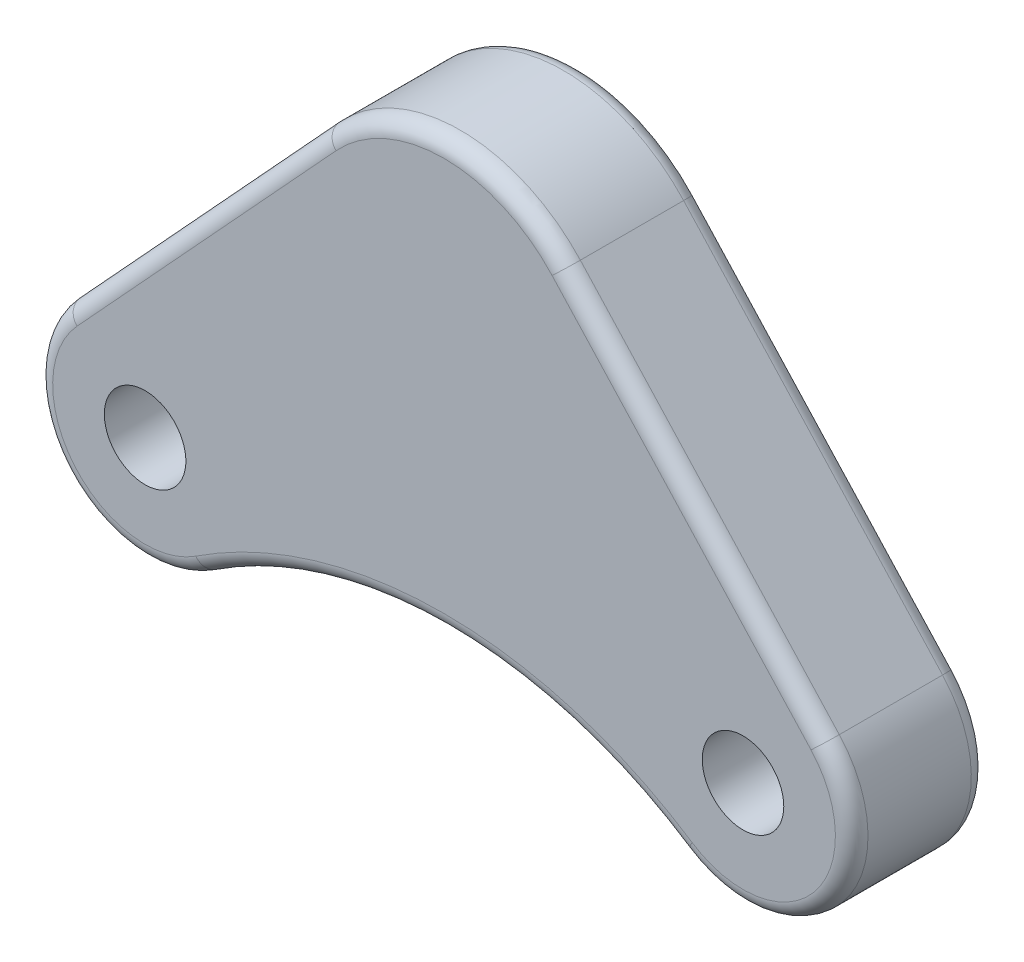
ISO-10303-21;
HEADER;
FILE_DESCRIPTION(('STEP AP214'),'2;1');
FILE_NAME('part.step','',(''),(''),'','','');
FILE_SCHEMA(('AUTOMOTIVE_DESIGN { 1 0 10303 214 1 1 1 1 }'));
ENDSEC;
DATA;
#1=APPLICATION_CONTEXT('core data for automotive mechanical design processes');
#2=APPLICATION_PROTOCOL_DEFINITION('international standard','automotive_design',2000,#1);
#3=PRODUCT_CONTEXT('',#1,'mechanical');
#4=PRODUCT('Part','Part','',(#3));
#5=PRODUCT_RELATED_PRODUCT_CATEGORY('part','',(#4));
#6=PRODUCT_DEFINITION_FORMATION('','',#4);
#7=PRODUCT_DEFINITION_CONTEXT('part definition',#1,'design');
#8=PRODUCT_DEFINITION('design','',#6,#7);
#9=PRODUCT_DEFINITION_SHAPE('','',#8);
#10=(LENGTH_UNIT() NAMED_UNIT(*) SI_UNIT(.MILLI.,.METRE.));
#11=(NAMED_UNIT(*) PLANE_ANGLE_UNIT() SI_UNIT($,.RADIAN.));
#12=(NAMED_UNIT(*) SI_UNIT($,.STERADIAN.) SOLID_ANGLE_UNIT());
#13=UNCERTAINTY_MEASURE_WITH_UNIT(LENGTH_MEASURE(1.E-05),#10,'distance_accuracy_value','');
#14=(GEOMETRIC_REPRESENTATION_CONTEXT(3) GLOBAL_UNCERTAINTY_ASSIGNED_CONTEXT((#13)) GLOBAL_UNIT_ASSIGNED_CONTEXT((#10,
#11,#12)) REPRESENTATION_CONTEXT('',''));
#15=CARTESIAN_POINT('',(0.,0.,0.));
#16=DIRECTION('',(0.,0.,1.));
#17=DIRECTION('',(1.,0.,0.));
#18=AXIS2_PLACEMENT_3D('',#15,#16,#17);
#19=CARTESIAN_POINT('',(0.,0.,25.));
#20=DIRECTION('',(0.,0.,-1.));
#21=DIRECTION('',(-1.,0.,0.));
#22=AXIS2_PLACEMENT_3D('',#19,#20,#21);
#23=PLANE('',#22);
#24=DIRECTION('',(-0.677147129080065,0.735847651065508,0.));
#25=VECTOR('',#24,1.);
#26=CARTESIAN_POINT('',(19.8678865787687,18.2829724851618,25.));
#27=LINE('',#26,#25);
#28=CARTESIAN_POINT('',(67.5094100681136,-33.4884988056389,25.));
#29=VERTEX_POINT('',#28);
#30=CARTESIAN_POINT('',(19.8678865787687,18.2829724851618,25.));
#31=VERTEX_POINT('',#30);
#32=EDGE_CURVE('E57',#29,#31,#27,.T.);
#33=ORIENTED_EDGE('',*,*,#32,.T.);
#34=CARTESIAN_POINT('',(0.,0.,25.));
#35=DIRECTION('',(0.,0.,-1.));
#36=DIRECTION('',(-1.,0.,0.));
#37=AXIS2_PLACEMENT_3D('',#34,#35,#36);
#38=CIRCLE('',#37,27.);
#39=CARTESIAN_POINT('',(-19.8678865787687,18.2829724851618,25.));
#40=VERTEX_POINT('',#39);
#41=EDGE_CURVE('E187',#31,#40,#38,.F.);
#42=ORIENTED_EDGE('',*,*,#41,.T.);
#43=DIRECTION('',(-0.677147129080065,-0.735847651065508,0.));
#44=VECTOR('',#43,1.);
#45=CARTESIAN_POINT('',(-19.8678865787687,18.2829724851618,25.));
#46=LINE('',#45,#44);
#47=CARTESIAN_POINT('',(-67.5094100681136,-33.4884988056389,25.));
#48=VERTEX_POINT('',#47);
#49=EDGE_CURVE('E195',#40,#48,#46,.T.);
#50=ORIENTED_EDGE('',*,*,#49,.T.);
#51=CARTESIAN_POINT('',(-55.,-45.,25.));
#52=DIRECTION('',(0.,0.,-1.));
#53=DIRECTION('',(-1.,0.,0.));
#54=AXIS2_PLACEMENT_3D('',#51,#52,#53);
#55=CIRCLE('',#54,17.);
#56=CARTESIAN_POINT('',(-45.65,-59.1977991252166,25.));
#57=VERTEX_POINT('',#56);
#58=EDGE_CURVE('E193',#48,#57,#55,.F.);
#59=ORIENTED_EDGE('',*,*,#58,.T.);
#60=CARTESIAN_POINT('',(0.,-128.51646544245,25.));
#61=DIRECTION('',(0.,0.,-1.));
#62=DIRECTION('',(-1.,0.,0.));
#63=AXIS2_PLACEMENT_3D('',#60,#61,#62);
#64=CIRCLE('',#63,83.);
#65=CARTESIAN_POINT('',(45.65,-59.1977991252166,25.));
#66=VERTEX_POINT('',#65);
#67=EDGE_CURVE('E191',#57,#66,#64,.T.);
#68=ORIENTED_EDGE('',*,*,#67,.T.);
#69=CARTESIAN_POINT('',(55.,-45.,25.));
#70=DIRECTION('',(0.,0.,-1.));
#71=DIRECTION('',(-1.,0.,0.));
#72=AXIS2_PLACEMENT_3D('',#69,#70,#71);
#73=CIRCLE('',#72,17.);
#74=EDGE_CURVE('E62',#66,#29,#73,.F.);
#75=ORIENTED_EDGE('',*,*,#74,.T.);
#76=EDGE_LOOP('',(#33,#42,#50,#59,#68,#75));
#77=FACE_BOUND('',#76,.T.);
#78=CARTESIAN_POINT('',(55.,-45.,25.));
#79=DIRECTION('',(0.,0.,1.));
#80=DIRECTION('',(1.,0.,0.));
#81=AXIS2_PLACEMENT_3D('',#78,#79,#80);
#82=CIRCLE('',#81,7.5);
#83=CARTESIAN_POINT('',(62.5,-45.,25.));
#84=VERTEX_POINT('',#83);
#85=EDGE_CURVE('E237',#84,#84,#82,.T.);
#86=ORIENTED_EDGE('',*,*,#85,.F.);
#87=EDGE_LOOP('',(#86));
#88=FACE_BOUND('',#87,.T.);
#89=CARTESIAN_POINT('',(-55.,-45.,25.));
#90=DIRECTION('',(0.,0.,1.));
#91=DIRECTION('',(-1.,0.,0.));
#92=AXIS2_PLACEMENT_3D('',#89,#90,#91);
#93=CIRCLE('',#92,7.5);
#94=CARTESIAN_POINT('',(-62.5,-45.,25.));
#95=VERTEX_POINT('',#94);
#96=EDGE_CURVE('E241',#95,#95,#93,.T.);
#97=ORIENTED_EDGE('',*,*,#96,.F.);
#98=EDGE_LOOP('',(#97));
#99=FACE_BOUND('',#98,.T.);
#100=ADVANCED_FACE('F40',(#77,#88,#99),#23,.F.);
#101=CARTESIAN_POINT('',(0.,0.,0.));
#102=DIRECTION('',(0.,0.,-1.));
#103=DIRECTION('',(-1.,0.,0.));
#104=AXIS2_PLACEMENT_3D('',#101,#102,#103);
#105=PLANE('',#104);
#106=DIRECTION('',(-0.677147129080065,0.735847651065508,0.));
#107=VECTOR('',#106,1.);
#108=CARTESIAN_POINT('',(67.5094100681137,-33.4884988056389,0.));
#109=LINE('',#108,#107);
#110=CARTESIAN_POINT('',(19.8678865787687,18.2829724851618,0.));
#111=VERTEX_POINT('',#110);
#112=CARTESIAN_POINT('',(67.5094100681136,-33.4884988056389,0.));
#113=VERTEX_POINT('',#112);
#114=EDGE_CURVE('E224',#111,#113,#109,.F.);
#115=ORIENTED_EDGE('',*,*,#114,.T.);
#116=CARTESIAN_POINT('',(55.,-45.,0.));
#117=DIRECTION('',(0.,0.,-1.));
#118=DIRECTION('',(-1.,0.,0.));
#119=AXIS2_PLACEMENT_3D('',#116,#117,#118);
#120=CIRCLE('',#119,17.);
#121=CARTESIAN_POINT('',(45.65,-59.1977991252166,0.));
#122=VERTEX_POINT('',#121);
#123=EDGE_CURVE('E213',#113,#122,#120,.T.);
#124=ORIENTED_EDGE('',*,*,#123,.T.);
#125=CARTESIAN_POINT('',(0.,-128.51646544245,0.));
#126=DIRECTION('',(0.,0.,-1.));
#127=DIRECTION('',(-1.,0.,0.));
#128=AXIS2_PLACEMENT_3D('',#125,#126,#127);
#129=CIRCLE('',#128,83.);
#130=CARTESIAN_POINT('',(-45.65,-59.1977991252166,0.));
#131=VERTEX_POINT('',#130);
#132=EDGE_CURVE('E216',#122,#131,#129,.F.);
#133=ORIENTED_EDGE('',*,*,#132,.T.);
#134=CARTESIAN_POINT('',(-55.,-45.,0.));
#135=DIRECTION('',(0.,0.,-1.));
#136=DIRECTION('',(-1.,0.,0.));
#137=AXIS2_PLACEMENT_3D('',#134,#135,#136);
#138=CIRCLE('',#137,17.);
#139=CARTESIAN_POINT('',(-67.5094100681136,-33.4884988056389,0.));
#140=VERTEX_POINT('',#139);
#141=EDGE_CURVE('E218',#131,#140,#138,.T.);
#142=ORIENTED_EDGE('',*,*,#141,.T.);
#143=DIRECTION('',(-0.677147129080065,-0.735847651065508,0.));
#144=VECTOR('',#143,1.);
#145=CARTESIAN_POINT('',(-19.8678865787687,18.2829724851618,0.));
#146=LINE('',#145,#144);
#147=CARTESIAN_POINT('',(-19.8678865787687,18.2829724851618,0.));
#148=VERTEX_POINT('',#147);
#149=EDGE_CURVE('E220',#140,#148,#146,.F.);
#150=ORIENTED_EDGE('',*,*,#149,.T.);
#151=CARTESIAN_POINT('',(0.,0.,0.));
#152=DIRECTION('',(0.,0.,-1.));
#153=DIRECTION('',(-1.,0.,0.));
#154=AXIS2_PLACEMENT_3D('',#151,#152,#153);
#155=CIRCLE('',#154,27.);
#156=EDGE_CURVE('E222',#148,#111,#155,.T.);
#157=ORIENTED_EDGE('',*,*,#156,.T.);
#158=EDGE_LOOP('',(#115,#124,#133,#142,#150,#157));
#159=FACE_BOUND('',#158,.T.);
#160=CARTESIAN_POINT('',(55.,-45.,0.));
#161=DIRECTION('',(0.,0.,1.));
#162=DIRECTION('',(1.,0.,0.));
#163=AXIS2_PLACEMENT_3D('',#160,#161,#162);
#164=CIRCLE('',#163,7.5);
#165=CARTESIAN_POINT('',(62.5,-45.,0.));
#166=VERTEX_POINT('',#165);
#167=EDGE_CURVE('E238',#166,#166,#164,.T.);
#168=ORIENTED_EDGE('',*,*,#167,.T.);
#169=EDGE_LOOP('',(#168));
#170=FACE_BOUND('',#169,.T.);
#171=CARTESIAN_POINT('',(-55.,-45.,0.));
#172=DIRECTION('',(0.,0.,1.));
#173=DIRECTION('',(-1.,0.,0.));
#174=AXIS2_PLACEMENT_3D('',#171,#172,#173);
#175=CIRCLE('',#174,7.5);
#176=CARTESIAN_POINT('',(-62.5,-45.,0.));
#177=VERTEX_POINT('',#176);
#178=EDGE_CURVE('E172',#177,#177,#175,.T.);
#179=ORIENTED_EDGE('',*,*,#178,.T.);
#180=EDGE_LOOP('',(#179));
#181=FACE_BOUND('',#180,.T.);
#182=ADVANCED_FACE('F253',(#159,#170,#181),#105,.T.);
#183=CARTESIAN_POINT('',(0.,0.,25.));
#184=DIRECTION('',(0.,0.,-1.));
#185=DIRECTION('',(-1.,0.,0.));
#186=AXIS2_PLACEMENT_3D('',#183,#184,#185);
#187=CYLINDRICAL_SURFACE('',#186,30.);
#188=DIRECTION('',(0.,0.,-1.));
#189=VECTOR('',#188,1.);
#190=CARTESIAN_POINT('',(22.0754295319652,20.314413872402,25.));
#191=LINE('',#190,#189);
#192=CARTESIAN_POINT('',(22.0754295319652,20.314413872402,22.));
#193=VERTEX_POINT('',#192);
#194=CARTESIAN_POINT('',(22.0754295319652,20.314413872402,3.));
#195=VERTEX_POINT('',#194);
#196=EDGE_CURVE('E135',#193,#195,#191,.T.);
#197=ORIENTED_EDGE('',*,*,#196,.T.);
#198=CARTESIAN_POINT('',(0.,0.,3.));
#199=DIRECTION('',(0.,0.,-1.));
#200=DIRECTION('',(-1.,0.,0.));
#201=AXIS2_PLACEMENT_3D('',#198,#199,#200);
#202=CIRCLE('',#201,30.);
#203=CARTESIAN_POINT('',(-22.0754295319652,20.314413872402,3.));
#204=VERTEX_POINT('',#203);
#205=EDGE_CURVE('E197',#195,#204,#202,.F.);
#206=ORIENTED_EDGE('',*,*,#205,.T.);
#207=DIRECTION('',(0.,0.,-1.));
#208=VECTOR('',#207,1.);
#209=CARTESIAN_POINT('',(-22.0754295319652,20.314413872402,25.));
#210=LINE('',#209,#208);
#211=CARTESIAN_POINT('',(-22.0754295319652,20.314413872402,22.));
#212=VERTEX_POINT('',#211);
#213=EDGE_CURVE('E155',#212,#204,#210,.T.);
#214=ORIENTED_EDGE('',*,*,#213,.F.);
#215=CARTESIAN_POINT('',(0.,0.,22.));
#216=DIRECTION('',(0.,0.,-1.));
#217=DIRECTION('',(-1.,0.,0.));
#218=AXIS2_PLACEMENT_3D('',#215,#216,#217);
#219=CIRCLE('',#218,30.);
#220=EDGE_CURVE('E199',#212,#193,#219,.T.);
#221=ORIENTED_EDGE('',*,*,#220,.T.);
#222=EDGE_LOOP('',(#197,#206,#214,#221));
#223=FACE_BOUND('',#222,.T.);
#224=ADVANCED_FACE('F258',(#223),#187,.T.);
#225=CARTESIAN_POINT('',(-22.0754295319652,20.314413872402,25.));
#226=DIRECTION('',(0.735847651065508,-0.677147129080065,0.));
#227=DIRECTION('',(0.677147129080065,0.735847651065508,0.));
#228=AXIS2_PLACEMENT_3D('',#225,#226,#227);
#229=PLANE('',#228);
#230=ORIENTED_EDGE('',*,*,#213,.T.);
#231=DIRECTION('',(-0.677147129080065,-0.735847651065508,0.));
#232=VECTOR('',#231,1.);
#233=CARTESIAN_POINT('',(-69.7169530213102,-31.4570574183987,3.));
#234=LINE('',#233,#232);
#235=CARTESIAN_POINT('',(-69.7169530213102,-31.4570574183987,3.));
#236=VERTEX_POINT('',#235);
#237=EDGE_CURVE('E201',#204,#236,#234,.T.);
#238=ORIENTED_EDGE('',*,*,#237,.T.);
#239=DIRECTION('',(0.,0.,-1.));
#240=VECTOR('',#239,1.);
#241=CARTESIAN_POINT('',(-69.7169530213102,-31.4570574183987,25.));
#242=LINE('',#241,#240);
#243=CARTESIAN_POINT('',(-69.7169530213102,-31.4570574183987,22.));
#244=VERTEX_POINT('',#243);
#245=EDGE_CURVE('E229',#244,#236,#242,.T.);
#246=ORIENTED_EDGE('',*,*,#245,.F.);
#247=DIRECTION('',(-0.677147129080065,-0.735847651065508,0.));
#248=VECTOR('',#247,1.);
#249=CARTESIAN_POINT('',(-22.0754295319652,20.314413872402,22.));
#250=LINE('',#249,#248);
#251=EDGE_CURVE('E203',#244,#212,#250,.F.);
#252=ORIENTED_EDGE('',*,*,#251,.T.);
#253=EDGE_LOOP('',(#230,#238,#246,#252));
#254=FACE_BOUND('',#253,.T.);
#255=ADVANCED_FACE('F277',(#254),#229,.F.);
#256=CARTESIAN_POINT('',(-55.,-45.,25.));
#257=DIRECTION('',(0.,0.,-1.));
#258=DIRECTION('',(-1.,0.,0.));
#259=AXIS2_PLACEMENT_3D('',#256,#257,#258);
#260=CYLINDRICAL_SURFACE('',#259,20.);
#261=ORIENTED_EDGE('',*,*,#245,.T.);
#262=CARTESIAN_POINT('',(-55.,-45.,3.));
#263=DIRECTION('',(0.,0.,-1.));
#264=DIRECTION('',(-1.,0.,0.));
#265=AXIS2_PLACEMENT_3D('',#262,#263,#264);
#266=CIRCLE('',#265,20.);
#267=CARTESIAN_POINT('',(-44.,-61.7032930884901,3.));
#268=VERTEX_POINT('',#267);
#269=EDGE_CURVE('E205',#236,#268,#266,.F.);
#270=ORIENTED_EDGE('',*,*,#269,.T.);
#271=DIRECTION('',(0.,0.,-1.));
#272=VECTOR('',#271,1.);
#273=CARTESIAN_POINT('',(-44.,-61.7032930884901,25.));
#274=LINE('',#273,#272);
#275=CARTESIAN_POINT('',(-44.,-61.7032930884901,22.));
#276=VERTEX_POINT('',#275);
#277=EDGE_CURVE('E232',#276,#268,#274,.T.);
#278=ORIENTED_EDGE('',*,*,#277,.F.);
#279=CARTESIAN_POINT('',(-55.,-45.,22.));
#280=DIRECTION('',(0.,0.,-1.));
#281=DIRECTION('',(-1.,0.,0.));
#282=AXIS2_PLACEMENT_3D('',#279,#280,#281);
#283=CIRCLE('',#282,20.);
#284=EDGE_CURVE('E207',#276,#244,#283,.T.);
#285=ORIENTED_EDGE('',*,*,#284,.T.);
#286=EDGE_LOOP('',(#261,#270,#278,#285));
#287=FACE_BOUND('',#286,.T.);
#288=ADVANCED_FACE('F273',(#287),#260,.T.);
#289=CARTESIAN_POINT('',(0.,-128.51646544245,25.));
#290=DIRECTION('',(0.,0.,-1.));
#291=DIRECTION('',(-1.,0.,0.));
#292=AXIS2_PLACEMENT_3D('',#289,#290,#291);
#293=CYLINDRICAL_SURFACE('',#292,80.);
#294=ORIENTED_EDGE('',*,*,#277,.T.);
#295=CARTESIAN_POINT('',(0.,-128.51646544245,3.));
#296=DIRECTION('',(0.,0.,-1.));
#297=DIRECTION('',(-1.,0.,0.));
#298=AXIS2_PLACEMENT_3D('',#295,#296,#297);
#299=CIRCLE('',#298,80.);
#300=CARTESIAN_POINT('',(44.,-61.7032930884901,3.));
#301=VERTEX_POINT('',#300);
#302=EDGE_CURVE('E209',#268,#301,#299,.T.);
#303=ORIENTED_EDGE('',*,*,#302,.T.);
#304=DIRECTION('',(0.,0.,-1.));
#305=VECTOR('',#304,1.);
#306=CARTESIAN_POINT('',(44.,-61.7032930884901,25.));
#307=LINE('',#306,#305);
#308=CARTESIAN_POINT('',(44.,-61.7032930884901,22.));
#309=VERTEX_POINT('',#308);
#310=EDGE_CURVE('E148',#309,#301,#307,.T.);
#311=ORIENTED_EDGE('',*,*,#310,.F.);
#312=CARTESIAN_POINT('',(0.,-128.51646544245,22.));
#313=DIRECTION('',(0.,0.,-1.));
#314=DIRECTION('',(-1.,0.,0.));
#315=AXIS2_PLACEMENT_3D('',#312,#313,#314);
#316=CIRCLE('',#315,80.);
#317=EDGE_CURVE('E211',#309,#276,#316,.F.);
#318=ORIENTED_EDGE('',*,*,#317,.T.);
#319=EDGE_LOOP('',(#294,#303,#311,#318));
#320=FACE_BOUND('',#319,.T.);
#321=ADVANCED_FACE('F270',(#320),#293,.F.);
#322=CARTESIAN_POINT('',(55.,-45.,25.));
#323=DIRECTION('',(0.,0.,-1.));
#324=DIRECTION('',(-1.,0.,0.));
#325=AXIS2_PLACEMENT_3D('',#322,#323,#324);
#326=CYLINDRICAL_SURFACE('',#325,20.);
#327=ORIENTED_EDGE('',*,*,#310,.T.);
#328=CARTESIAN_POINT('',(55.,-45.,3.));
#329=DIRECTION('',(0.,0.,-1.));
#330=DIRECTION('',(-1.,0.,0.));
#331=AXIS2_PLACEMENT_3D('',#328,#329,#330);
#332=CIRCLE('',#331,20.);
#333=CARTESIAN_POINT('',(69.7169530213102,-31.4570574183987,3.));
#334=VERTEX_POINT('',#333);
#335=EDGE_CURVE('E147',#301,#334,#332,.F.);
#336=ORIENTED_EDGE('',*,*,#335,.T.);
#337=DIRECTION('',(0.,0.,-1.));
#338=VECTOR('',#337,1.);
#339=CARTESIAN_POINT('',(69.7169530213102,-31.4570574183987,25.));
#340=LINE('',#339,#338);
#341=CARTESIAN_POINT('',(69.7169530213102,-31.4570574183987,22.));
#342=VERTEX_POINT('',#341);
#343=EDGE_CURVE('E133',#342,#334,#340,.T.);
#344=ORIENTED_EDGE('',*,*,#343,.F.);
#345=CARTESIAN_POINT('',(55.,-45.,22.));
#346=DIRECTION('',(0.,0.,-1.));
#347=DIRECTION('',(-1.,0.,0.));
#348=AXIS2_PLACEMENT_3D('',#345,#346,#347);
#349=CIRCLE('',#348,20.);
#350=EDGE_CURVE('E144',#342,#309,#349,.T.);
#351=ORIENTED_EDGE('',*,*,#350,.T.);
#352=EDGE_LOOP('',(#327,#336,#344,#351));
#353=FACE_BOUND('',#352,.T.);
#354=ADVANCED_FACE('F143',(#353),#326,.T.);
#355=CARTESIAN_POINT('',(22.0754295319652,20.314413872402,25.));
#356=DIRECTION('',(-0.735847651065508,-0.677147129080065,0.));
#357=DIRECTION('',(0.677147129080065,-0.735847651065508,0.));
#358=AXIS2_PLACEMENT_3D('',#355,#356,#357);
#359=PLANE('',#358);
#360=ORIENTED_EDGE('',*,*,#196,.F.);
#361=DIRECTION('',(-0.677147129080065,0.735847651065508,0.));
#362=VECTOR('',#361,1.);
#363=CARTESIAN_POINT('',(22.0754295319652,20.314413872402,22.));
#364=LINE('',#363,#362);
#365=EDGE_CURVE('E11',#193,#342,#364,.F.);
#366=ORIENTED_EDGE('',*,*,#365,.T.);
#367=ORIENTED_EDGE('',*,*,#343,.T.);
#368=DIRECTION('',(-0.677147129080065,0.735847651065508,0.));
#369=VECTOR('',#368,1.);
#370=CARTESIAN_POINT('',(22.0754295319652,20.314413872402,3.));
#371=LINE('',#370,#369);
#372=EDGE_CURVE('E49',#334,#195,#371,.T.);
#373=ORIENTED_EDGE('',*,*,#372,.T.);
#374=EDGE_LOOP('',(#360,#366,#367,#373));
#375=FACE_BOUND('',#374,.T.);
#376=ADVANCED_FACE('F132',(#375),#359,.F.);
#377=CARTESIAN_POINT('',(55.,-45.,25.));
#378=DIRECTION('',(0.,0.,-1.));
#379=DIRECTION('',(-1.,0.,0.));
#380=AXIS2_PLACEMENT_3D('',#377,#378,#379);
#381=CYLINDRICAL_SURFACE('',#380,7.5);
#382=ORIENTED_EDGE('',*,*,#85,.T.);
#383=EDGE_LOOP('',(#382));
#384=FACE_BOUND('',#383,.T.);
#385=ORIENTED_EDGE('',*,*,#167,.F.);
#386=EDGE_LOOP('',(#385));
#387=FACE_BOUND('',#386,.T.);
#388=ADVANCED_FACE('F263',(#384,#387),#381,.F.);
#389=CARTESIAN_POINT('',(-55.,-45.,25.));
#390=DIRECTION('',(0.,0.,-1.));
#391=DIRECTION('',(-1.,0.,0.));
#392=AXIS2_PLACEMENT_3D('',#389,#390,#391);
#393=CYLINDRICAL_SURFACE('',#392,7.5);
#394=ORIENTED_EDGE('',*,*,#96,.T.);
#395=EDGE_LOOP('',(#394));
#396=FACE_BOUND('',#395,.T.);
#397=ORIENTED_EDGE('',*,*,#178,.F.);
#398=EDGE_LOOP('',(#397));
#399=FACE_BOUND('',#398,.T.);
#400=ADVANCED_FACE('F249',(#396,#399),#393,.F.);
#401=CARTESIAN_POINT('',(-19.8678865787687,18.2829724851618,3.));
#402=DIRECTION('',(0.677147129080065,0.735847651065508,0.));
#403=DIRECTION('',(-0.735847651065508,0.677147129080065,0.));
#404=AXIS2_PLACEMENT_3D('',#401,#402,#403);
#405=CYLINDRICAL_SURFACE('',#404,3.);
#406=CARTESIAN_POINT('',(-19.8678865787687,18.2829724851618,3.));
#407=DIRECTION('',(0.677147129080066,0.735847651065508,0.));
#408=DIRECTION('',(-0.735847651065508,0.677147129080066,0.));
#409=AXIS2_PLACEMENT_3D('',#406,#407,#408);
#410=CIRCLE('',#409,3.);
#411=EDGE_CURVE('E173',#148,#204,#410,.T.);
#412=ORIENTED_EDGE('',*,*,#411,.F.);
#413=ORIENTED_EDGE('',*,*,#149,.F.);
#414=CARTESIAN_POINT('',(-67.5094100681136,-33.4884988056389,3.));
#415=DIRECTION('',(-0.677147129080064,-0.735847651065509,0.));
#416=DIRECTION('',(0.735847651065509,-0.677147129080064,0.));
#417=AXIS2_PLACEMENT_3D('',#414,#415,#416);
#418=CIRCLE('',#417,3.);
#419=EDGE_CURVE('E169',#236,#140,#418,.T.);
#420=ORIENTED_EDGE('',*,*,#419,.F.);
#421=ORIENTED_EDGE('',*,*,#237,.F.);
#422=EDGE_LOOP('',(#412,#413,#420,#421));
#423=FACE_BOUND('',#422,.T.);
#424=ADVANCED_FACE('F304',(#423),#405,.T.);
#425=CARTESIAN_POINT('',(-55.,-45.,3.));
#426=DIRECTION('',(0.,0.,-1.));
#427=DIRECTION('',(-1.,0.,0.));
#428=AXIS2_PLACEMENT_3D('',#425,#426,#427);
#429=TOROIDAL_SURFACE('',#428,17.,3.);
#430=ORIENTED_EDGE('',*,*,#419,.T.);
#431=ORIENTED_EDGE('',*,*,#141,.F.);
#432=CARTESIAN_POINT('',(-45.65,-59.1977991252166,3.));
#433=DIRECTION('',(0.835164654424503,0.55,0.));
#434=DIRECTION('',(-0.55,0.835164654424503,0.));
#435=AXIS2_PLACEMENT_3D('',#432,#433,#434);
#436=CIRCLE('',#435,3.);
#437=EDGE_CURVE('E176',#268,#131,#436,.T.);
#438=ORIENTED_EDGE('',*,*,#437,.F.);
#439=ORIENTED_EDGE('',*,*,#269,.F.);
#440=EDGE_LOOP('',(#430,#431,#438,#439));
#441=FACE_BOUND('',#440,.T.);
#442=ADVANCED_FACE('F300',(#441),#429,.T.);
#443=CARTESIAN_POINT('',(0.,0.,3.));
#444=DIRECTION('',(0.,0.,-1.));
#445=DIRECTION('',(-1.,0.,0.));
#446=AXIS2_PLACEMENT_3D('',#443,#444,#445);
#447=TOROIDAL_SURFACE('',#446,27.,3.);
#448=ORIENTED_EDGE('',*,*,#411,.T.);
#449=ORIENTED_EDGE('',*,*,#205,.F.);
#450=CARTESIAN_POINT('',(19.8678865787687,18.2829724851618,3.));
#451=DIRECTION('',(0.677147129080065,-0.735847651065508,0.));
#452=DIRECTION('',(0.735847651065508,0.677147129080065,0.));
#453=AXIS2_PLACEMENT_3D('',#450,#451,#452);
#454=CIRCLE('',#453,3.);
#455=EDGE_CURVE('E179',#111,#195,#454,.T.);
#456=ORIENTED_EDGE('',*,*,#455,.F.);
#457=ORIENTED_EDGE('',*,*,#156,.F.);
#458=EDGE_LOOP('',(#448,#449,#456,#457));
#459=FACE_BOUND('',#458,.T.);
#460=ADVANCED_FACE('F296',(#459),#447,.T.);
#461=CARTESIAN_POINT('',(0.,-128.51646544245,3.));
#462=DIRECTION('',(0.,0.,-1.));
#463=DIRECTION('',(-1.,0.,0.));
#464=AXIS2_PLACEMENT_3D('',#461,#462,#463);
#465=TOROIDAL_SURFACE('',#464,83.,3.);
#466=ORIENTED_EDGE('',*,*,#437,.T.);
#467=ORIENTED_EDGE('',*,*,#132,.F.);
#468=CARTESIAN_POINT('',(45.65,-59.1977991252166,3.));
#469=DIRECTION('',(0.835164654424503,-0.55,0.));
#470=DIRECTION('',(0.55,0.835164654424503,0.));
#471=AXIS2_PLACEMENT_3D('',#468,#469,#470);
#472=CIRCLE('',#471,3.);
#473=EDGE_CURVE('E182',#301,#122,#472,.T.);
#474=ORIENTED_EDGE('',*,*,#473,.F.);
#475=ORIENTED_EDGE('',*,*,#302,.F.);
#476=EDGE_LOOP('',(#466,#467,#474,#475));
#477=FACE_BOUND('',#476,.T.);
#478=ADVANCED_FACE('F292',(#477),#465,.T.);
#479=CARTESIAN_POINT('',(19.8678865787687,18.2829724851618,3.));
#480=DIRECTION('',(0.677147129080065,-0.735847651065508,0.));
#481=DIRECTION('',(0.735847651065508,0.677147129080065,0.));
#482=AXIS2_PLACEMENT_3D('',#479,#480,#481);
#483=CYLINDRICAL_SURFACE('',#482,3.);
#484=ORIENTED_EDGE('',*,*,#455,.T.);
#485=ORIENTED_EDGE('',*,*,#372,.F.);
#486=CARTESIAN_POINT('',(67.5094100681136,-33.4884988056389,3.));
#487=DIRECTION('',(0.677147129080063,-0.73584765106551,0.));
#488=DIRECTION('',(0.73584765106551,0.677147129080063,0.));
#489=AXIS2_PLACEMENT_3D('',#486,#487,#488);
#490=CIRCLE('',#489,3.);
#491=EDGE_CURVE('E184',#113,#334,#490,.T.);
#492=ORIENTED_EDGE('',*,*,#491,.F.);
#493=ORIENTED_EDGE('',*,*,#114,.F.);
#494=EDGE_LOOP('',(#484,#485,#492,#493));
#495=FACE_BOUND('',#494,.T.);
#496=ADVANCED_FACE('F288',(#495),#483,.T.);
#497=CARTESIAN_POINT('',(55.,-45.,3.));
#498=DIRECTION('',(0.,0.,-1.));
#499=DIRECTION('',(-1.,0.,0.));
#500=AXIS2_PLACEMENT_3D('',#497,#498,#499);
#501=TOROIDAL_SURFACE('',#500,17.,3.);
#502=ORIENTED_EDGE('',*,*,#473,.T.);
#503=ORIENTED_EDGE('',*,*,#123,.F.);
#504=ORIENTED_EDGE('',*,*,#491,.T.);
#505=ORIENTED_EDGE('',*,*,#335,.F.);
#506=EDGE_LOOP('',(#502,#503,#504,#505));
#507=FACE_BOUND('',#506,.T.);
#508=ADVANCED_FACE('F285',(#507),#501,.T.);
#509=CARTESIAN_POINT('',(0.,-128.51646544245,22.));
#510=DIRECTION('',(0.,0.,-1.));
#511=DIRECTION('',(-1.,0.,0.));
#512=AXIS2_PLACEMENT_3D('',#509,#510,#511);
#513=TOROIDAL_SURFACE('',#512,83.,3.);
#514=CARTESIAN_POINT('',(-45.65,-59.1977991252165,22.));
#515=DIRECTION('',(-0.835164654424503,-0.55,0.));
#516=DIRECTION('',(0.55,-0.835164654424503,0.));
#517=AXIS2_PLACEMENT_3D('',#514,#515,#516);
#518=CIRCLE('',#517,3.);
#519=EDGE_CURVE('E158',#276,#57,#518,.T.);
#520=ORIENTED_EDGE('',*,*,#519,.F.);
#521=ORIENTED_EDGE('',*,*,#317,.F.);
#522=CARTESIAN_POINT('',(45.65,-59.1977991252166,22.));
#523=DIRECTION('',(0.835164654424503,-0.55,0.));
#524=DIRECTION('',(0.55,0.835164654424503,0.));
#525=AXIS2_PLACEMENT_3D('',#522,#523,#524);
#526=CIRCLE('',#525,3.);
#527=EDGE_CURVE('E44',#66,#309,#526,.T.);
#528=ORIENTED_EDGE('',*,*,#527,.F.);
#529=ORIENTED_EDGE('',*,*,#67,.F.);
#530=EDGE_LOOP('',(#520,#521,#528,#529));
#531=FACE_BOUND('',#530,.T.);
#532=ADVANCED_FACE('F42',(#531),#513,.T.);
#533=CARTESIAN_POINT('',(55.,-45.,22.));
#534=DIRECTION('',(0.,0.,-1.));
#535=DIRECTION('',(-1.,0.,0.));
#536=AXIS2_PLACEMENT_3D('',#533,#534,#535);
#537=TOROIDAL_SURFACE('',#536,17.,3.);
#538=ORIENTED_EDGE('',*,*,#527,.T.);
#539=ORIENTED_EDGE('',*,*,#350,.F.);
#540=CARTESIAN_POINT('',(67.5094100681136,-33.4884988056389,22.));
#541=DIRECTION('',(-0.677147129080063,0.73584765106551,0.));
#542=DIRECTION('',(-0.73584765106551,-0.677147129080063,0.));
#543=AXIS2_PLACEMENT_3D('',#540,#541,#542);
#544=CIRCLE('',#543,3.);
#545=EDGE_CURVE('E153',#29,#342,#544,.T.);
#546=ORIENTED_EDGE('',*,*,#545,.F.);
#547=ORIENTED_EDGE('',*,*,#74,.F.);
#548=EDGE_LOOP('',(#538,#539,#546,#547));
#549=FACE_BOUND('',#548,.T.);
#550=ADVANCED_FACE('F152',(#549),#537,.T.);
#551=CARTESIAN_POINT('',(-55.,-45.,22.));
#552=DIRECTION('',(0.,0.,-1.));
#553=DIRECTION('',(-1.,0.,0.));
#554=AXIS2_PLACEMENT_3D('',#551,#552,#553);
#555=TOROIDAL_SURFACE('',#554,17.,3.);
#556=ORIENTED_EDGE('',*,*,#519,.T.);
#557=ORIENTED_EDGE('',*,*,#58,.F.);
#558=CARTESIAN_POINT('',(-67.5094100681136,-33.4884988056389,22.));
#559=DIRECTION('',(0.677147129080064,0.735847651065509,0.));
#560=DIRECTION('',(-0.735847651065509,0.677147129080064,0.));
#561=AXIS2_PLACEMENT_3D('',#558,#559,#560);
#562=CIRCLE('',#561,3.);
#563=EDGE_CURVE('E159',#244,#48,#562,.T.);
#564=ORIENTED_EDGE('',*,*,#563,.F.);
#565=ORIENTED_EDGE('',*,*,#284,.F.);
#566=EDGE_LOOP('',(#556,#557,#564,#565));
#567=FACE_BOUND('',#566,.T.);
#568=ADVANCED_FACE('F319',(#567),#555,.T.);
#569=CARTESIAN_POINT('',(19.8678865787687,18.2829724851618,22.));
#570=DIRECTION('',(-0.677147129080065,0.735847651065508,0.));
#571=DIRECTION('',(-0.735847651065508,-0.677147129080065,0.));
#572=AXIS2_PLACEMENT_3D('',#569,#570,#571);
#573=CYLINDRICAL_SURFACE('',#572,3.);
#574=ORIENTED_EDGE('',*,*,#545,.T.);
#575=ORIENTED_EDGE('',*,*,#365,.F.);
#576=CARTESIAN_POINT('',(19.8678865787687,18.2829724851618,22.));
#577=DIRECTION('',(-0.677147129080065,0.735847651065508,0.));
#578=DIRECTION('',(-0.735847651065508,-0.677147129080065,0.));
#579=AXIS2_PLACEMENT_3D('',#576,#577,#578);
#580=CIRCLE('',#579,3.);
#581=EDGE_CURVE('E163',#31,#193,#580,.T.);
#582=ORIENTED_EDGE('',*,*,#581,.F.);
#583=ORIENTED_EDGE('',*,*,#32,.F.);
#584=EDGE_LOOP('',(#574,#575,#582,#583));
#585=FACE_BOUND('',#584,.T.);
#586=ADVANCED_FACE('F157',(#585),#573,.T.);
#587=CARTESIAN_POINT('',(-19.8678865787687,18.2829724851618,22.));
#588=DIRECTION('',(-0.677147129080065,-0.735847651065508,0.));
#589=DIRECTION('',(0.735847651065508,-0.677147129080065,0.));
#590=AXIS2_PLACEMENT_3D('',#587,#588,#589);
#591=CYLINDRICAL_SURFACE('',#590,3.);
#592=ORIENTED_EDGE('',*,*,#563,.T.);
#593=ORIENTED_EDGE('',*,*,#49,.F.);
#594=CARTESIAN_POINT('',(-19.8678865787687,18.2829724851618,22.));
#595=DIRECTION('',(0.677147129080065,0.735847651065508,0.));
#596=DIRECTION('',(-0.735847651065508,0.677147129080065,0.));
#597=AXIS2_PLACEMENT_3D('',#594,#595,#596);
#598=CIRCLE('',#597,3.);
#599=EDGE_CURVE('E167',#212,#40,#598,.T.);
#600=ORIENTED_EDGE('',*,*,#599,.F.);
#601=ORIENTED_EDGE('',*,*,#251,.F.);
#602=EDGE_LOOP('',(#592,#593,#600,#601));
#603=FACE_BOUND('',#602,.T.);
#604=ADVANCED_FACE('F312',(#603),#591,.T.);
#605=CARTESIAN_POINT('',(0.,0.,22.));
#606=DIRECTION('',(0.,0.,-1.));
#607=DIRECTION('',(-1.,0.,0.));
#608=AXIS2_PLACEMENT_3D('',#605,#606,#607);
#609=TOROIDAL_SURFACE('',#608,27.,3.);
#610=ORIENTED_EDGE('',*,*,#581,.T.);
#611=ORIENTED_EDGE('',*,*,#220,.F.);
#612=ORIENTED_EDGE('',*,*,#599,.T.);
#613=ORIENTED_EDGE('',*,*,#41,.F.);
#614=EDGE_LOOP('',(#610,#611,#612,#613));
#615=FACE_BOUND('',#614,.T.);
#616=ADVANCED_FACE('F309',(#615),#609,.T.);
#617=CLOSED_SHELL('',(#100,#182,#224,#255,#288,#321,#354,#376,#388,#400,#424,#442,#460,#478,
#496,#508,#532,#550,#568,#586,#604,#616));
#618=MANIFOLD_SOLID_BREP('B2',#617);
#619=ADVANCED_BREP_SHAPE_REPRESENTATION('',(#18,#618),#14);
#620=SHAPE_DEFINITION_REPRESENTATION(#9,#619);
ENDSEC;
END-ISO-10303-21;
